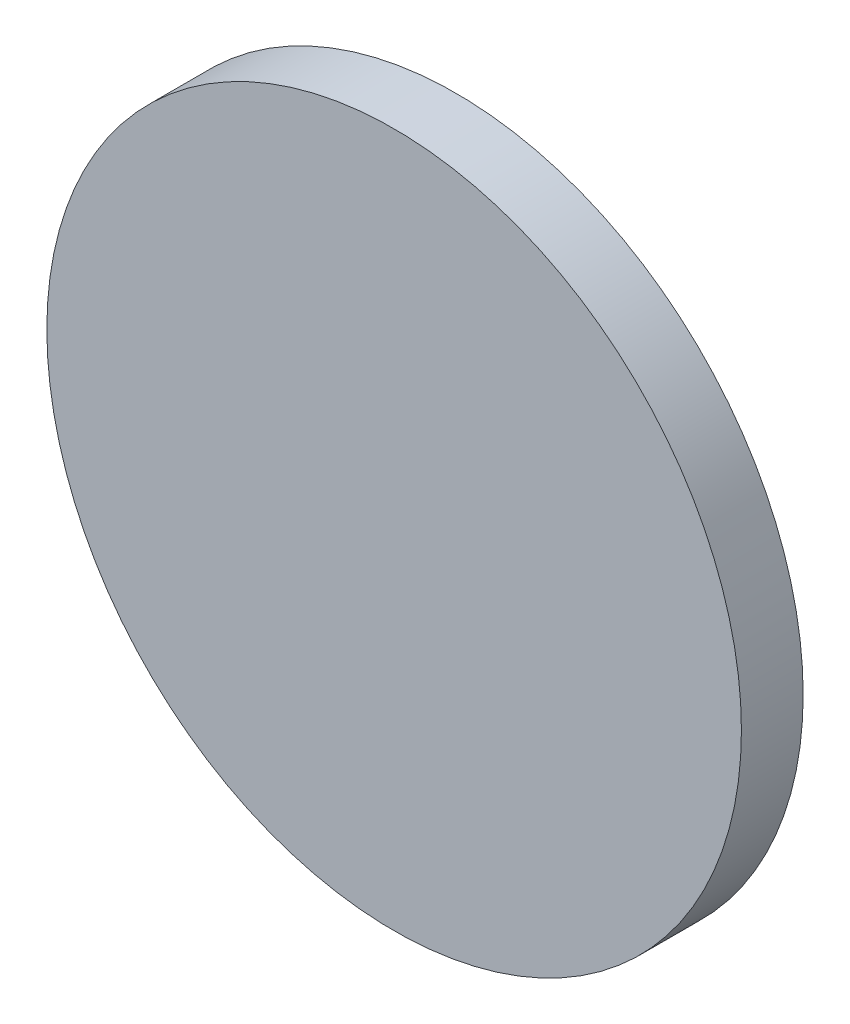
ISO-10303-21;
HEADER;
FILE_DESCRIPTION(('STEP AP214'),'2;1');
FILE_NAME('part.step','',(''),(''),'','','');
FILE_SCHEMA(('AUTOMOTIVE_DESIGN { 1 0 10303 214 1 1 1 1 }'));
ENDSEC;
DATA;
#1=APPLICATION_CONTEXT('core data for automotive mechanical design processes');
#2=APPLICATION_PROTOCOL_DEFINITION('international standard','automotive_design',2000,#1);
#3=PRODUCT_CONTEXT('',#1,'mechanical');
#4=PRODUCT('Part','Part','',(#3));
#5=PRODUCT_RELATED_PRODUCT_CATEGORY('part','',(#4));
#6=PRODUCT_DEFINITION_FORMATION('','',#4);
#7=PRODUCT_DEFINITION_CONTEXT('part definition',#1,'design');
#8=PRODUCT_DEFINITION('design','',#6,#7);
#9=PRODUCT_DEFINITION_SHAPE('','',#8);
#10=(LENGTH_UNIT() NAMED_UNIT(*) SI_UNIT(.MILLI.,.METRE.));
#11=(NAMED_UNIT(*) PLANE_ANGLE_UNIT() SI_UNIT($,.RADIAN.));
#12=(NAMED_UNIT(*) SI_UNIT($,.STERADIAN.) SOLID_ANGLE_UNIT());
#13=UNCERTAINTY_MEASURE_WITH_UNIT(LENGTH_MEASURE(1.E-05),#10,'distance_accuracy_value','');
#14=(GEOMETRIC_REPRESENTATION_CONTEXT(3) GLOBAL_UNCERTAINTY_ASSIGNED_CONTEXT((#13)) GLOBAL_UNIT_ASSIGNED_CONTEXT((#10,
#11,#12)) REPRESENTATION_CONTEXT('',''));
#15=CARTESIAN_POINT('',(0.,0.,0.));
#16=DIRECTION('',(0.,0.,1.));
#17=DIRECTION('',(1.,0.,0.));
#18=AXIS2_PLACEMENT_3D('',#15,#16,#17);
#19=CARTESIAN_POINT('',(-9.108,-9.108,0.));
#20=DIRECTION('',(0.,0.,1.));
#21=DIRECTION('',(1.,0.,0.));
#22=AXIS2_PLACEMENT_3D('',#19,#20,#21);
#23=PLANE('',#22);
#24=CARTESIAN_POINT('',(0.,0.,0.));
#25=DIRECTION('',(0.,0.,-1.));
#26=DIRECTION('',(-1.,0.,0.));
#27=AXIS2_PLACEMENT_3D('',#24,#25,#26);
#28=CIRCLE('',#27,9.);
#29=CARTESIAN_POINT('',(-9.,0.,0.));
#30=VERTEX_POINT('',#29);
#31=EDGE_CURVE('E19',#30,#30,#28,.T.);
#32=ORIENTED_EDGE('',*,*,#31,.T.);
#33=EDGE_LOOP('',(#32));
#34=FACE_BOUND('',#33,.T.);
#35=ADVANCED_FACE('F15',(#34),#23,.F.);
#36=CARTESIAN_POINT('',(-9.108,-9.108,1.6));
#37=DIRECTION('',(0.,0.,1.));
#38=DIRECTION('',(1.,0.,0.));
#39=AXIS2_PLACEMENT_3D('',#36,#37,#38);
#40=PLANE('',#39);
#41=CARTESIAN_POINT('',(0.,0.,1.6));
#42=DIRECTION('',(0.,0.,-1.));
#43=DIRECTION('',(-1.,0.,0.));
#44=AXIS2_PLACEMENT_3D('',#41,#42,#43);
#45=CIRCLE('',#44,9.);
#46=CARTESIAN_POINT('',(-9.,0.,1.6));
#47=VERTEX_POINT('',#46);
#48=EDGE_CURVE('E10',#47,#47,#45,.F.);
#49=ORIENTED_EDGE('',*,*,#48,.T.);
#50=EDGE_LOOP('',(#49));
#51=FACE_BOUND('',#50,.T.);
#52=ADVANCED_FACE('F17',(#51),#40,.T.);
#53=CARTESIAN_POINT('',(0.,0.,1.6));
#54=DIRECTION('',(0.,0.,-1.));
#55=DIRECTION('',(-1.,0.,0.));
#56=AXIS2_PLACEMENT_3D('',#53,#54,#55);
#57=CYLINDRICAL_SURFACE('',#56,9.);
#58=ORIENTED_EDGE('',*,*,#48,.F.);
#59=EDGE_LOOP('',(#58));
#60=FACE_BOUND('',#59,.T.);
#61=ORIENTED_EDGE('',*,*,#31,.F.);
#62=EDGE_LOOP('',(#61));
#63=FACE_BOUND('',#62,.T.);
#64=ADVANCED_FACE('F29',(#60,#63),#57,.T.);
#65=CLOSED_SHELL('',(#35,#52,#64));
#66=MANIFOLD_SOLID_BREP('B1',#65);
#67=ADVANCED_BREP_SHAPE_REPRESENTATION('',(#18,#66),#14);
#68=SHAPE_DEFINITION_REPRESENTATION(#9,#67);
ENDSEC;
END-ISO-10303-21;
